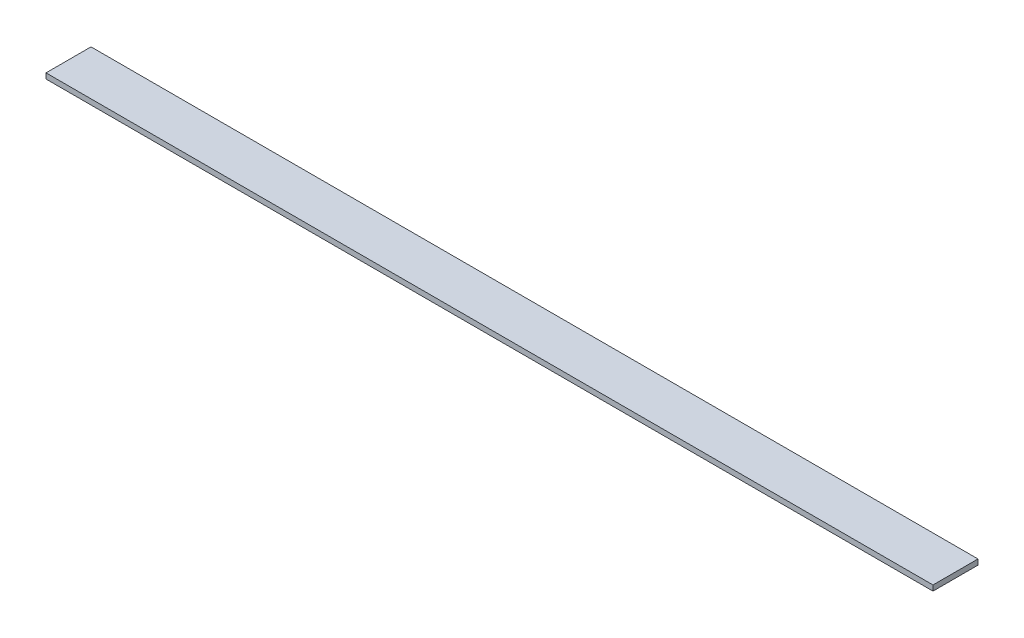
ISO-10303-21;
HEADER;
FILE_DESCRIPTION(('STEP AP214'),'2;1');
FILE_NAME('part.step','',(''),(''),'','','');
FILE_SCHEMA(('AUTOMOTIVE_DESIGN { 1 0 10303 214 1 1 1 1 }'));
ENDSEC;
DATA;
#1=APPLICATION_CONTEXT('core data for automotive mechanical design processes');
#2=APPLICATION_PROTOCOL_DEFINITION('international standard','automotive_design',2000,#1);
#3=PRODUCT_CONTEXT('',#1,'mechanical');
#4=PRODUCT('Part','Part','',(#3));
#5=PRODUCT_RELATED_PRODUCT_CATEGORY('part','',(#4));
#6=PRODUCT_DEFINITION_FORMATION('','',#4);
#7=PRODUCT_DEFINITION_CONTEXT('part definition',#1,'design');
#8=PRODUCT_DEFINITION('design','',#6,#7);
#9=PRODUCT_DEFINITION_SHAPE('','',#8);
#10=(LENGTH_UNIT() NAMED_UNIT(*) SI_UNIT(.MILLI.,.METRE.));
#11=(NAMED_UNIT(*) PLANE_ANGLE_UNIT() SI_UNIT($,.RADIAN.));
#12=(NAMED_UNIT(*) SI_UNIT($,.STERADIAN.) SOLID_ANGLE_UNIT());
#13=UNCERTAINTY_MEASURE_WITH_UNIT(LENGTH_MEASURE(1.E-05),#10,'distance_accuracy_value','');
#14=(GEOMETRIC_REPRESENTATION_CONTEXT(3) GLOBAL_UNCERTAINTY_ASSIGNED_CONTEXT((#13)) GLOBAL_UNIT_ASSIGNED_CONTEXT((#10,
#11,#12)) REPRESENTATION_CONTEXT('',''));
#15=CARTESIAN_POINT('',(0.,0.,0.));
#16=DIRECTION('',(0.,0.,1.));
#17=DIRECTION('',(1.,0.,0.));
#18=AXIS2_PLACEMENT_3D('',#15,#16,#17);
#19=CARTESIAN_POINT('',(165.,-1.,8.375));
#20=DIRECTION('',(0.,0.,-1.));
#21=DIRECTION('',(-1.,0.,0.));
#22=AXIS2_PLACEMENT_3D('',#19,#20,#21);
#23=PLANE('',#22);
#24=DIRECTION('',(0.,-1.,0.));
#25=VECTOR('',#24,1.);
#26=CARTESIAN_POINT('',(-165.,-1.,8.375));
#27=LINE('',#26,#25);
#28=CARTESIAN_POINT('',(-165.,0.999999999999999,8.375));
#29=VERTEX_POINT('',#28);
#30=CARTESIAN_POINT('',(-165.,-1.,8.375));
#31=VERTEX_POINT('',#30);
#32=EDGE_CURVE('E95',#29,#31,#27,.T.);
#33=ORIENTED_EDGE('',*,*,#32,.T.);
#34=DIRECTION('',(-1.,0.,0.));
#35=VECTOR('',#34,1.);
#36=CARTESIAN_POINT('',(165.,-1.,8.375));
#37=LINE('',#36,#35);
#38=CARTESIAN_POINT('',(165.,-1.,8.375));
#39=VERTEX_POINT('',#38);
#40=EDGE_CURVE('E11',#39,#31,#37,.T.);
#41=ORIENTED_EDGE('',*,*,#40,.F.);
#42=DIRECTION('',(0.,-1.,0.));
#43=VECTOR('',#42,1.);
#44=CARTESIAN_POINT('',(165.,-1.,8.375));
#45=LINE('',#44,#43);
#46=CARTESIAN_POINT('',(165.,0.999999999999999,8.375));
#47=VERTEX_POINT('',#46);
#48=EDGE_CURVE('E83',#47,#39,#45,.T.);
#49=ORIENTED_EDGE('',*,*,#48,.F.);
#50=DIRECTION('',(-1.,0.,0.));
#51=VECTOR('',#50,1.);
#52=CARTESIAN_POINT('',(165.,0.999999999999999,8.375));
#53=LINE('',#52,#51);
#54=EDGE_CURVE('E91',#47,#29,#53,.T.);
#55=ORIENTED_EDGE('',*,*,#54,.T.);
#56=EDGE_LOOP('',(#33,#41,#49,#55));
#57=FACE_BOUND('',#56,.T.);
#58=ADVANCED_FACE('F32',(#57),#23,.F.);
#59=CARTESIAN_POINT('',(165.,-0.999999999999999,-8.375));
#60=DIRECTION('',(0.,1.,0.));
#61=DIRECTION('',(0.,0.,1.));
#62=AXIS2_PLACEMENT_3D('',#59,#60,#61);
#63=PLANE('',#62);
#64=DIRECTION('',(0.,0.,-1.));
#65=VECTOR('',#64,1.);
#66=CARTESIAN_POINT('',(-165.,-0.999999999999999,-8.375));
#67=LINE('',#66,#65);
#68=CARTESIAN_POINT('',(-165.,-0.999999999999999,-8.375));
#69=VERTEX_POINT('',#68);
#70=EDGE_CURVE('E87',#31,#69,#67,.T.);
#71=ORIENTED_EDGE('',*,*,#70,.T.);
#72=DIRECTION('',(-1.,0.,0.));
#73=VECTOR('',#72,1.);
#74=CARTESIAN_POINT('',(165.,-0.999999999999999,-8.375));
#75=LINE('',#74,#73);
#76=CARTESIAN_POINT('',(165.,-0.999999999999999,-8.375));
#77=VERTEX_POINT('',#76);
#78=EDGE_CURVE('E40',#77,#69,#75,.T.);
#79=ORIENTED_EDGE('',*,*,#78,.F.);
#80=DIRECTION('',(0.,0.,-1.));
#81=VECTOR('',#80,1.);
#82=CARTESIAN_POINT('',(165.,-0.999999999999999,-8.375));
#83=LINE('',#82,#81);
#84=EDGE_CURVE('E78',#39,#77,#83,.T.);
#85=ORIENTED_EDGE('',*,*,#84,.F.);
#86=ORIENTED_EDGE('',*,*,#40,.T.);
#87=EDGE_LOOP('',(#71,#79,#85,#86));
#88=FACE_BOUND('',#87,.T.);
#89=ADVANCED_FACE('F86',(#88),#63,.F.);
#90=CARTESIAN_POINT('',(165.,-0.999999999999999,-8.375));
#91=DIRECTION('',(0.,0.,1.));
#92=DIRECTION('',(1.,0.,0.));
#93=AXIS2_PLACEMENT_3D('',#90,#91,#92);
#94=PLANE('',#93);
#95=DIRECTION('',(0.,1.,0.));
#96=VECTOR('',#95,1.);
#97=CARTESIAN_POINT('',(-165.,-0.999999999999999,-8.375));
#98=LINE('',#97,#96);
#99=CARTESIAN_POINT('',(-165.,1.,-8.375));
#100=VERTEX_POINT('',#99);
#101=EDGE_CURVE('E65',#69,#100,#98,.T.);
#102=ORIENTED_EDGE('',*,*,#101,.T.);
#103=DIRECTION('',(-1.,0.,0.));
#104=VECTOR('',#103,1.);
#105=CARTESIAN_POINT('',(165.,1.,-8.375));
#106=LINE('',#105,#104);
#107=CARTESIAN_POINT('',(165.,1.,-8.375));
#108=VERTEX_POINT('',#107);
#109=EDGE_CURVE('E88',#108,#100,#106,.T.);
#110=ORIENTED_EDGE('',*,*,#109,.F.);
#111=DIRECTION('',(0.,1.,0.));
#112=VECTOR('',#111,1.);
#113=CARTESIAN_POINT('',(165.,-0.999999999999999,-8.375));
#114=LINE('',#113,#112);
#115=EDGE_CURVE('E81',#77,#108,#114,.T.);
#116=ORIENTED_EDGE('',*,*,#115,.F.);
#117=ORIENTED_EDGE('',*,*,#78,.T.);
#118=EDGE_LOOP('',(#102,#110,#116,#117));
#119=FACE_BOUND('',#118,.T.);
#120=ADVANCED_FACE('F89',(#119),#94,.F.);
#121=CARTESIAN_POINT('',(165.,1.,-8.375));
#122=DIRECTION('',(0.,-1.,0.));
#123=DIRECTION('',(0.,0.,-1.));
#124=AXIS2_PLACEMENT_3D('',#121,#122,#123);
#125=PLANE('',#124);
#126=DIRECTION('',(0.,0.,1.));
#127=VECTOR('',#126,1.);
#128=CARTESIAN_POINT('',(-165.,1.,-8.375));
#129=LINE('',#128,#127);
#130=EDGE_CURVE('E71',#100,#29,#129,.T.);
#131=ORIENTED_EDGE('',*,*,#130,.T.);
#132=ORIENTED_EDGE('',*,*,#54,.F.);
#133=DIRECTION('',(0.,0.,1.));
#134=VECTOR('',#133,1.);
#135=CARTESIAN_POINT('',(165.,1.,-8.375));
#136=LINE('',#135,#134);
#137=EDGE_CURVE('E48',#108,#47,#136,.T.);
#138=ORIENTED_EDGE('',*,*,#137,.F.);
#139=ORIENTED_EDGE('',*,*,#109,.T.);
#140=EDGE_LOOP('',(#131,#132,#138,#139));
#141=FACE_BOUND('',#140,.T.);
#142=ADVANCED_FACE('F102',(#141),#125,.F.);
#143=CARTESIAN_POINT('',(165.,0.,0.));
#144=DIRECTION('',(1.,0.,0.));
#145=DIRECTION('',(0.,0.,-1.));
#146=AXIS2_PLACEMENT_3D('',#143,#144,#145);
#147=PLANE('',#146);
#148=ORIENTED_EDGE('',*,*,#48,.T.);
#149=ORIENTED_EDGE('',*,*,#84,.T.);
#150=ORIENTED_EDGE('',*,*,#115,.T.);
#151=ORIENTED_EDGE('',*,*,#137,.T.);
#152=EDGE_LOOP('',(#148,#149,#150,#151));
#153=FACE_BOUND('',#152,.T.);
#154=ADVANCED_FACE('F79',(#153),#147,.T.);
#155=CARTESIAN_POINT('',(-165.,0.,0.));
#156=DIRECTION('',(1.,0.,0.));
#157=DIRECTION('',(0.,0.,-1.));
#158=AXIS2_PLACEMENT_3D('',#155,#156,#157);
#159=PLANE('',#158);
#160=ORIENTED_EDGE('',*,*,#32,.F.);
#161=ORIENTED_EDGE('',*,*,#130,.F.);
#162=ORIENTED_EDGE('',*,*,#101,.F.);
#163=ORIENTED_EDGE('',*,*,#70,.F.);
#164=EDGE_LOOP('',(#160,#161,#162,#163));
#165=FACE_BOUND('',#164,.T.);
#166=ADVANCED_FACE('F105',(#165),#159,.F.);
#167=CLOSED_SHELL('',(#58,#89,#120,#142,#154,#166));
#168=MANIFOLD_SOLID_BREP('B2',#167);
#169=ADVANCED_BREP_SHAPE_REPRESENTATION('',(#18,#168),#14);
#170=SHAPE_DEFINITION_REPRESENTATION(#9,#169);
ENDSEC;
END-ISO-10303-21;
